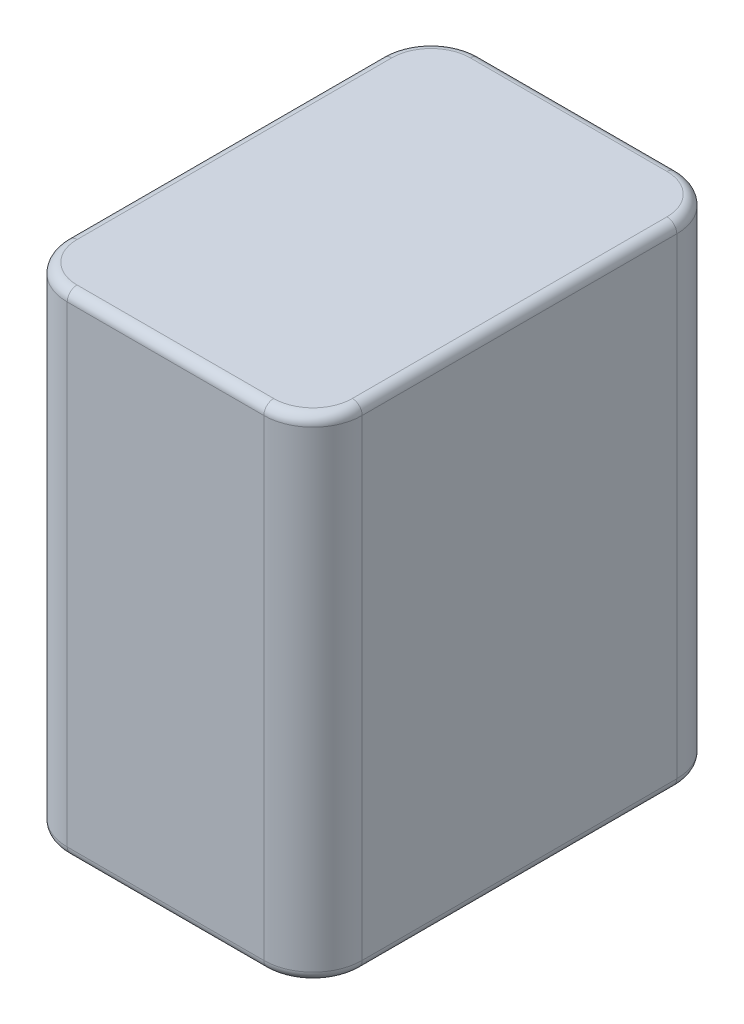
ISO-10303-21;
HEADER;
FILE_DESCRIPTION(('STEP AP214'),'2;1');
FILE_NAME('part.step','',(''),(''),'','','');
FILE_SCHEMA(('AUTOMOTIVE_DESIGN { 1 0 10303 214 1 1 1 1 }'));
ENDSEC;
DATA;
#1=APPLICATION_CONTEXT('core data for automotive mechanical design processes');
#2=APPLICATION_PROTOCOL_DEFINITION('international standard','automotive_design',2000,#1);
#3=PRODUCT_CONTEXT('',#1,'mechanical');
#4=PRODUCT('Part','Part','',(#3));
#5=PRODUCT_RELATED_PRODUCT_CATEGORY('part','',(#4));
#6=PRODUCT_DEFINITION_FORMATION('','',#4);
#7=PRODUCT_DEFINITION_CONTEXT('part definition',#1,'design');
#8=PRODUCT_DEFINITION('design','',#6,#7);
#9=PRODUCT_DEFINITION_SHAPE('','',#8);
#10=(LENGTH_UNIT() NAMED_UNIT(*) SI_UNIT(.MILLI.,.METRE.));
#11=(NAMED_UNIT(*) PLANE_ANGLE_UNIT() SI_UNIT($,.RADIAN.));
#12=(NAMED_UNIT(*) SI_UNIT($,.STERADIAN.) SOLID_ANGLE_UNIT());
#13=UNCERTAINTY_MEASURE_WITH_UNIT(LENGTH_MEASURE(1.E-05),#10,'distance_accuracy_value','');
#14=(GEOMETRIC_REPRESENTATION_CONTEXT(3) GLOBAL_UNCERTAINTY_ASSIGNED_CONTEXT((#13)) GLOBAL_UNIT_ASSIGNED_CONTEXT((#10,
#11,#12)) REPRESENTATION_CONTEXT('',''));
#15=CARTESIAN_POINT('',(0.,0.,0.));
#16=DIRECTION('',(0.,0.,1.));
#17=DIRECTION('',(1.,0.,0.));
#18=AXIS2_PLACEMENT_3D('',#15,#16,#17);
#19=CARTESIAN_POINT('',(0.,25.,0.));
#20=DIRECTION('',(1.,0.,0.));
#21=DIRECTION('',(0.,0.,-1.));
#22=AXIS2_PLACEMENT_3D('',#19,#20,#21);
#23=PLANE('',#22);
#24=DIRECTION('',(0.,-1.,0.));
#25=VECTOR('',#24,1.);
#26=CARTESIAN_POINT('',(0.,25.,-37.));
#27=LINE('',#26,#25);
#28=CARTESIAN_POINT('',(0.,24.,-37.));
#29=VERTEX_POINT('',#28);
#30=CARTESIAN_POINT('',(0.,-24.,-37.));
#31=VERTEX_POINT('',#30);
#32=EDGE_CURVE('E333',#29,#31,#27,.T.);
#33=ORIENTED_EDGE('',*,*,#32,.T.);
#34=DIRECTION('',(0.,0.,1.));
#35=VECTOR('',#34,1.);
#36=CARTESIAN_POINT('',(0.,-24.,-5.));
#37=LINE('',#36,#35);
#38=CARTESIAN_POINT('',(0.,-24.,-5.));
#39=VERTEX_POINT('',#38);
#40=EDGE_CURVE('E11',#31,#39,#37,.T.);
#41=ORIENTED_EDGE('',*,*,#40,.T.);
#42=DIRECTION('',(0.,-1.,0.));
#43=VECTOR('',#42,1.);
#44=CARTESIAN_POINT('',(0.,25.,-5.));
#45=LINE('',#44,#43);
#46=CARTESIAN_POINT('',(0.,24.,-5.));
#47=VERTEX_POINT('',#46);
#48=EDGE_CURVE('E242',#39,#47,#45,.F.);
#49=ORIENTED_EDGE('',*,*,#48,.T.);
#50=DIRECTION('',(0.,0.,1.));
#51=VECTOR('',#50,1.);
#52=CARTESIAN_POINT('',(0.,24.,0.));
#53=LINE('',#52,#51);
#54=EDGE_CURVE('E207',#47,#29,#53,.F.);
#55=ORIENTED_EDGE('',*,*,#54,.T.);
#56=EDGE_LOOP('',(#33,#41,#49,#55));
#57=FACE_BOUND('',#56,.T.);
#58=ADVANCED_FACE('F39',(#57),#23,.F.);
#59=CARTESIAN_POINT('',(0.,25.,0.));
#60=DIRECTION('',(0.,0.,-1.));
#61=DIRECTION('',(-1.,0.,0.));
#62=AXIS2_PLACEMENT_3D('',#59,#60,#61);
#63=PLANE('',#62);
#64=DIRECTION('',(0.,-1.,0.));
#65=VECTOR('',#64,1.);
#66=CARTESIAN_POINT('',(5.,25.,0.));
#67=LINE('',#66,#65);
#68=CARTESIAN_POINT('',(5.,24.,0.));
#69=VERTEX_POINT('',#68);
#70=CARTESIAN_POINT('',(5.,-24.,0.));
#71=VERTEX_POINT('',#70);
#72=EDGE_CURVE('E344',#69,#71,#67,.T.);
#73=ORIENTED_EDGE('',*,*,#72,.T.);
#74=DIRECTION('',(1.,0.,0.));
#75=VECTOR('',#74,1.);
#76=CARTESIAN_POINT('',(25.,-24.,0.));
#77=LINE('',#76,#75);
#78=CARTESIAN_POINT('',(25.,-24.,0.));
#79=VERTEX_POINT('',#78);
#80=EDGE_CURVE('E271',#71,#79,#77,.T.);
#81=ORIENTED_EDGE('',*,*,#80,.T.);
#82=DIRECTION('',(0.,-1.,0.));
#83=VECTOR('',#82,1.);
#84=CARTESIAN_POINT('',(25.,25.,0.));
#85=LINE('',#84,#83);
#86=CARTESIAN_POINT('',(25.,24.,0.));
#87=VERTEX_POINT('',#86);
#88=EDGE_CURVE('E337',#79,#87,#85,.F.);
#89=ORIENTED_EDGE('',*,*,#88,.T.);
#90=DIRECTION('',(1.,0.,0.));
#91=VECTOR('',#90,1.);
#92=CARTESIAN_POINT('',(0.,24.,0.));
#93=LINE('',#92,#91);
#94=EDGE_CURVE('E200',#87,#69,#93,.F.);
#95=ORIENTED_EDGE('',*,*,#94,.T.);
#96=EDGE_LOOP('',(#73,#81,#89,#95));
#97=FACE_BOUND('',#96,.T.);
#98=ADVANCED_FACE('F425',(#97),#63,.F.);
#99=CARTESIAN_POINT('',(30.,25.,0.));
#100=DIRECTION('',(-1.,0.,0.));
#101=DIRECTION('',(0.,0.,1.));
#102=AXIS2_PLACEMENT_3D('',#99,#100,#101);
#103=PLANE('',#102);
#104=DIRECTION('',(0.,-1.,0.));
#105=VECTOR('',#104,1.);
#106=CARTESIAN_POINT('',(30.,25.,-5.));
#107=LINE('',#106,#105);
#108=CARTESIAN_POINT('',(30.,24.,-5.));
#109=VERTEX_POINT('',#108);
#110=CARTESIAN_POINT('',(30.,-24.,-5.));
#111=VERTEX_POINT('',#110);
#112=EDGE_CURVE('E348',#109,#111,#107,.T.);
#113=ORIENTED_EDGE('',*,*,#112,.T.);
#114=DIRECTION('',(0.,0.,-1.));
#115=VECTOR('',#114,1.);
#116=CARTESIAN_POINT('',(30.,-24.,-37.));
#117=LINE('',#116,#115);
#118=CARTESIAN_POINT('',(30.,-24.,-37.));
#119=VERTEX_POINT('',#118);
#120=EDGE_CURVE('E277',#111,#119,#117,.T.);
#121=ORIENTED_EDGE('',*,*,#120,.T.);
#122=DIRECTION('',(0.,-1.,0.));
#123=VECTOR('',#122,1.);
#124=CARTESIAN_POINT('',(30.,25.,-37.));
#125=LINE('',#124,#123);
#126=CARTESIAN_POINT('',(30.,24.,-37.));
#127=VERTEX_POINT('',#126);
#128=EDGE_CURVE('E178',#119,#127,#125,.F.);
#129=ORIENTED_EDGE('',*,*,#128,.T.);
#130=DIRECTION('',(0.,0.,-1.));
#131=VECTOR('',#130,1.);
#132=CARTESIAN_POINT('',(30.,24.,0.));
#133=LINE('',#132,#131);
#134=EDGE_CURVE('E188',#127,#109,#133,.F.);
#135=ORIENTED_EDGE('',*,*,#134,.T.);
#136=EDGE_LOOP('',(#113,#121,#129,#135));
#137=FACE_BOUND('',#136,.T.);
#138=ADVANCED_FACE('F377',(#137),#103,.F.);
#139=CARTESIAN_POINT('',(0.,25.,-42.));
#140=DIRECTION('',(0.,0.,1.));
#141=DIRECTION('',(1.,0.,0.));
#142=AXIS2_PLACEMENT_3D('',#139,#140,#141);
#143=PLANE('',#142);
#144=DIRECTION('',(0.,-1.,0.));
#145=VECTOR('',#144,1.);
#146=CARTESIAN_POINT('',(25.,25.,-42.));
#147=LINE('',#146,#145);
#148=CARTESIAN_POINT('',(25.,24.,-42.));
#149=VERTEX_POINT('',#148);
#150=CARTESIAN_POINT('',(25.,-24.,-42.));
#151=VERTEX_POINT('',#150);
#152=EDGE_CURVE('E329',#149,#151,#147,.T.);
#153=ORIENTED_EDGE('',*,*,#152,.T.);
#154=DIRECTION('',(-1.,0.,0.));
#155=VECTOR('',#154,1.);
#156=CARTESIAN_POINT('',(5.,-24.,-42.));
#157=LINE('',#156,#155);
#158=CARTESIAN_POINT('',(5.,-24.,-42.));
#159=VERTEX_POINT('',#158);
#160=EDGE_CURVE('E64',#151,#159,#157,.T.);
#161=ORIENTED_EDGE('',*,*,#160,.T.);
#162=DIRECTION('',(0.,-1.,0.));
#163=VECTOR('',#162,1.);
#164=CARTESIAN_POINT('',(5.,25.,-42.));
#165=LINE('',#164,#163);
#166=CARTESIAN_POINT('',(5.,24.,-42.));
#167=VERTEX_POINT('',#166);
#168=EDGE_CURVE('E332',#159,#167,#165,.F.);
#169=ORIENTED_EDGE('',*,*,#168,.T.);
#170=DIRECTION('',(-1.,0.,0.));
#171=VECTOR('',#170,1.);
#172=CARTESIAN_POINT('',(0.,24.,-42.));
#173=LINE('',#172,#171);
#174=EDGE_CURVE('E214',#167,#149,#173,.F.);
#175=ORIENTED_EDGE('',*,*,#174,.T.);
#176=EDGE_LOOP('',(#153,#161,#169,#175));
#177=FACE_BOUND('',#176,.T.);
#178=ADVANCED_FACE('F330',(#177),#143,.F.);
#179=CARTESIAN_POINT('',(0.,25.,0.));
#180=DIRECTION('',(0.,-1.,0.));
#181=DIRECTION('',(0.,0.,-1.));
#182=AXIS2_PLACEMENT_3D('',#179,#180,#181);
#183=PLANE('',#182);
#184=DIRECTION('',(0.,0.,-1.));
#185=VECTOR('',#184,1.);
#186=CARTESIAN_POINT('',(29.,25.,0.));
#187=LINE('',#186,#185);
#188=CARTESIAN_POINT('',(29.,25.,-5.));
#189=VERTEX_POINT('',#188);
#190=CARTESIAN_POINT('',(29.,25.,-37.));
#191=VERTEX_POINT('',#190);
#192=EDGE_CURVE('E182',#189,#191,#187,.T.);
#193=ORIENTED_EDGE('',*,*,#192,.T.);
#194=CARTESIAN_POINT('',(25.,25.,-37.));
#195=DIRECTION('',(0.,-1.,0.));
#196=DIRECTION('',(0.,0.,-1.));
#197=AXIS2_PLACEMENT_3D('',#194,#195,#196);
#198=CIRCLE('',#197,4.);
#199=CARTESIAN_POINT('',(25.,25.,-41.));
#200=VERTEX_POINT('',#199);
#201=EDGE_CURVE('E161',#191,#200,#198,.F.);
#202=ORIENTED_EDGE('',*,*,#201,.T.);
#203=DIRECTION('',(-1.,0.,0.));
#204=VECTOR('',#203,1.);
#205=CARTESIAN_POINT('',(0.,25.,-41.));
#206=LINE('',#205,#204);
#207=CARTESIAN_POINT('',(5.,25.,-41.));
#208=VERTEX_POINT('',#207);
#209=EDGE_CURVE('E170',#200,#208,#206,.T.);
#210=ORIENTED_EDGE('',*,*,#209,.T.);
#211=CARTESIAN_POINT('',(5.,25.,-37.));
#212=DIRECTION('',(0.,-1.,0.));
#213=DIRECTION('',(0.,0.,-1.));
#214=AXIS2_PLACEMENT_3D('',#211,#212,#213);
#215=CIRCLE('',#214,4.);
#216=CARTESIAN_POINT('',(0.999999999999999,25.,-37.));
#217=VERTEX_POINT('',#216);
#218=EDGE_CURVE('E177',#208,#217,#215,.F.);
#219=ORIENTED_EDGE('',*,*,#218,.T.);
#220=DIRECTION('',(0.,0.,1.));
#221=VECTOR('',#220,1.);
#222=CARTESIAN_POINT('',(1.,25.,0.));
#223=LINE('',#222,#221);
#224=CARTESIAN_POINT('',(1.,25.,-5.));
#225=VERTEX_POINT('',#224);
#226=EDGE_CURVE('E356',#217,#225,#223,.T.);
#227=ORIENTED_EDGE('',*,*,#226,.T.);
#228=CARTESIAN_POINT('',(5.,25.,-5.));
#229=DIRECTION('',(0.,-1.,0.));
#230=DIRECTION('',(0.,0.,-1.));
#231=AXIS2_PLACEMENT_3D('',#228,#229,#230);
#232=CIRCLE('',#231,4.);
#233=CARTESIAN_POINT('',(5.,25.,-1.));
#234=VERTEX_POINT('',#233);
#235=EDGE_CURVE('E359',#225,#234,#232,.F.);
#236=ORIENTED_EDGE('',*,*,#235,.T.);
#237=DIRECTION('',(1.,0.,0.));
#238=VECTOR('',#237,1.);
#239=CARTESIAN_POINT('',(0.,25.,-1.));
#240=LINE('',#239,#238);
#241=CARTESIAN_POINT('',(25.,25.,-1.));
#242=VERTEX_POINT('',#241);
#243=EDGE_CURVE('E362',#234,#242,#240,.T.);
#244=ORIENTED_EDGE('',*,*,#243,.T.);
#245=CARTESIAN_POINT('',(25.,25.,-5.));
#246=DIRECTION('',(0.,-1.,0.));
#247=DIRECTION('',(0.,0.,-1.));
#248=AXIS2_PLACEMENT_3D('',#245,#246,#247);
#249=CIRCLE('',#248,4.);
#250=EDGE_CURVE('E190',#242,#189,#249,.F.);
#251=ORIENTED_EDGE('',*,*,#250,.T.);
#252=EDGE_LOOP('',(#193,#202,#210,#219,#227,#236,#244,#251));
#253=FACE_BOUND('',#252,.T.);
#254=ADVANCED_FACE('F180',(#253),#183,.F.);
#255=CARTESIAN_POINT('',(0.,-25.,0.));
#256=DIRECTION('',(0.,-1.,0.));
#257=DIRECTION('',(0.,0.,-1.));
#258=AXIS2_PLACEMENT_3D('',#255,#256,#257);
#259=PLANE('',#258);
#260=DIRECTION('',(1.,0.,0.));
#261=VECTOR('',#260,1.);
#262=CARTESIAN_POINT('',(5.,-25.,-1.));
#263=LINE('',#262,#261);
#264=CARTESIAN_POINT('',(25.,-25.,-1.));
#265=VERTEX_POINT('',#264);
#266=CARTESIAN_POINT('',(5.,-25.,-1.));
#267=VERTEX_POINT('',#266);
#268=EDGE_CURVE('E260',#265,#267,#263,.F.);
#269=ORIENTED_EDGE('',*,*,#268,.T.);
#270=CARTESIAN_POINT('',(5.,-25.,-5.));
#271=DIRECTION('',(0.,-1.,0.));
#272=DIRECTION('',(0.,0.,-1.));
#273=AXIS2_PLACEMENT_3D('',#270,#271,#272);
#274=CIRCLE('',#273,4.);
#275=CARTESIAN_POINT('',(1.,-25.,-5.));
#276=VERTEX_POINT('',#275);
#277=EDGE_CURVE('E263',#267,#276,#274,.T.);
#278=ORIENTED_EDGE('',*,*,#277,.T.);
#279=DIRECTION('',(0.,0.,1.));
#280=VECTOR('',#279,1.);
#281=CARTESIAN_POINT('',(1.,-25.,-37.));
#282=LINE('',#281,#280);
#283=CARTESIAN_POINT('',(1.,-25.,-37.));
#284=VERTEX_POINT('',#283);
#285=EDGE_CURVE('E216',#276,#284,#282,.F.);
#286=ORIENTED_EDGE('',*,*,#285,.T.);
#287=CARTESIAN_POINT('',(5.,-25.,-37.));
#288=DIRECTION('',(0.,-1.,0.));
#289=DIRECTION('',(0.,0.,-1.));
#290=AXIS2_PLACEMENT_3D('',#287,#288,#289);
#291=CIRCLE('',#290,4.);
#292=CARTESIAN_POINT('',(5.,-25.,-41.));
#293=VERTEX_POINT('',#292);
#294=EDGE_CURVE('E245',#284,#293,#291,.T.);
#295=ORIENTED_EDGE('',*,*,#294,.T.);
#296=DIRECTION('',(-1.,0.,0.));
#297=VECTOR('',#296,1.);
#298=CARTESIAN_POINT('',(25.,-25.,-41.));
#299=LINE('',#298,#297);
#300=CARTESIAN_POINT('',(25.,-25.,-41.));
#301=VERTEX_POINT('',#300);
#302=EDGE_CURVE('E248',#293,#301,#299,.F.);
#303=ORIENTED_EDGE('',*,*,#302,.T.);
#304=CARTESIAN_POINT('',(25.,-25.,-37.));
#305=DIRECTION('',(0.,-1.,0.));
#306=DIRECTION('',(0.,0.,-1.));
#307=AXIS2_PLACEMENT_3D('',#304,#305,#306);
#308=CIRCLE('',#307,4.);
#309=CARTESIAN_POINT('',(29.,-25.,-37.));
#310=VERTEX_POINT('',#309);
#311=EDGE_CURVE('E251',#301,#310,#308,.T.);
#312=ORIENTED_EDGE('',*,*,#311,.T.);
#313=DIRECTION('',(0.,0.,-1.));
#314=VECTOR('',#313,1.);
#315=CARTESIAN_POINT('',(29.,-25.,-5.));
#316=LINE('',#315,#314);
#317=CARTESIAN_POINT('',(29.,-25.,-5.));
#318=VERTEX_POINT('',#317);
#319=EDGE_CURVE('E254',#310,#318,#316,.F.);
#320=ORIENTED_EDGE('',*,*,#319,.T.);
#321=CARTESIAN_POINT('',(25.,-25.,-5.));
#322=DIRECTION('',(0.,-1.,0.));
#323=DIRECTION('',(0.,0.,-1.));
#324=AXIS2_PLACEMENT_3D('',#321,#322,#323);
#325=CIRCLE('',#324,4.);
#326=EDGE_CURVE('E257',#318,#265,#325,.T.);
#327=ORIENTED_EDGE('',*,*,#326,.T.);
#328=EDGE_LOOP('',(#269,#278,#286,#295,#303,#312,#320,#327));
#329=FACE_BOUND('',#328,.T.);
#330=ADVANCED_FACE('F394',(#329),#259,.T.);
#331=CARTESIAN_POINT('',(5.,25.,-37.));
#332=DIRECTION('',(0.,-1.,0.));
#333=DIRECTION('',(0.,0.,-1.));
#334=AXIS2_PLACEMENT_3D('',#331,#332,#333);
#335=CYLINDRICAL_SURFACE('',#334,5.);
#336=ORIENTED_EDGE('',*,*,#168,.F.);
#337=CARTESIAN_POINT('',(5.,-24.,-37.));
#338=DIRECTION('',(0.,-1.,0.));
#339=DIRECTION('',(0.,0.,-1.));
#340=AXIS2_PLACEMENT_3D('',#337,#338,#339);
#341=CIRCLE('',#340,5.);
#342=EDGE_CURVE('E49',#159,#31,#341,.F.);
#343=ORIENTED_EDGE('',*,*,#342,.T.);
#344=ORIENTED_EDGE('',*,*,#32,.F.);
#345=CARTESIAN_POINT('',(5.,24.,-37.));
#346=DIRECTION('',(0.,-1.,0.));
#347=DIRECTION('',(0.,0.,-1.));
#348=AXIS2_PLACEMENT_3D('',#345,#346,#347);
#349=CIRCLE('',#348,5.);
#350=EDGE_CURVE('E210',#29,#167,#349,.T.);
#351=ORIENTED_EDGE('',*,*,#350,.T.);
#352=EDGE_LOOP('',(#336,#343,#344,#351));
#353=FACE_BOUND('',#352,.T.);
#354=ADVANCED_FACE('F434',(#353),#335,.T.);
#355=CARTESIAN_POINT('',(5.,25.,-5.));
#356=DIRECTION('',(0.,-1.,0.));
#357=DIRECTION('',(0.,0.,-1.));
#358=AXIS2_PLACEMENT_3D('',#355,#356,#357);
#359=CYLINDRICAL_SURFACE('',#358,5.);
#360=ORIENTED_EDGE('',*,*,#48,.F.);
#361=CARTESIAN_POINT('',(5.,-24.,-5.));
#362=DIRECTION('',(0.,-1.,0.));
#363=DIRECTION('',(0.,0.,-1.));
#364=AXIS2_PLACEMENT_3D('',#361,#362,#363);
#365=CIRCLE('',#364,5.);
#366=EDGE_CURVE('E267',#39,#71,#365,.F.);
#367=ORIENTED_EDGE('',*,*,#366,.T.);
#368=ORIENTED_EDGE('',*,*,#72,.F.);
#369=CARTESIAN_POINT('',(5.,24.,-5.));
#370=DIRECTION('',(0.,-1.,0.));
#371=DIRECTION('',(0.,0.,-1.));
#372=AXIS2_PLACEMENT_3D('',#369,#370,#371);
#373=CIRCLE('',#372,5.);
#374=EDGE_CURVE('E203',#69,#47,#373,.T.);
#375=ORIENTED_EDGE('',*,*,#374,.T.);
#376=EDGE_LOOP('',(#360,#367,#368,#375));
#377=FACE_BOUND('',#376,.T.);
#378=ADVANCED_FACE('F410',(#377),#359,.T.);
#379=CARTESIAN_POINT('',(25.,25.,-37.));
#380=DIRECTION('',(0.,-1.,0.));
#381=DIRECTION('',(0.,0.,-1.));
#382=AXIS2_PLACEMENT_3D('',#379,#380,#381);
#383=CYLINDRICAL_SURFACE('',#382,5.);
#384=ORIENTED_EDGE('',*,*,#128,.F.);
#385=CARTESIAN_POINT('',(25.,-24.,-37.));
#386=DIRECTION('',(0.,-1.,0.));
#387=DIRECTION('',(0.,0.,-1.));
#388=AXIS2_PLACEMENT_3D('',#385,#386,#387);
#389=CIRCLE('',#388,5.);
#390=EDGE_CURVE('E280',#119,#151,#389,.F.);
#391=ORIENTED_EDGE('',*,*,#390,.T.);
#392=ORIENTED_EDGE('',*,*,#152,.F.);
#393=CARTESIAN_POINT('',(25.,24.,-37.));
#394=DIRECTION('',(0.,-1.,0.));
#395=DIRECTION('',(0.,0.,-1.));
#396=AXIS2_PLACEMENT_3D('',#393,#394,#395);
#397=CIRCLE('',#396,5.);
#398=EDGE_CURVE('E163',#149,#127,#397,.T.);
#399=ORIENTED_EDGE('',*,*,#398,.T.);
#400=EDGE_LOOP('',(#384,#391,#392,#399));
#401=FACE_BOUND('',#400,.T.);
#402=ADVANCED_FACE('F328',(#401),#383,.T.);
#403=CARTESIAN_POINT('',(25.,25.,-5.));
#404=DIRECTION('',(0.,-1.,0.));
#405=DIRECTION('',(0.,0.,-1.));
#406=AXIS2_PLACEMENT_3D('',#403,#404,#405);
#407=CYLINDRICAL_SURFACE('',#406,5.);
#408=ORIENTED_EDGE('',*,*,#88,.F.);
#409=CARTESIAN_POINT('',(25.,-24.,-5.));
#410=DIRECTION('',(0.,-1.,0.));
#411=DIRECTION('',(0.,0.,-1.));
#412=AXIS2_PLACEMENT_3D('',#409,#410,#411);
#413=CIRCLE('',#412,5.);
#414=EDGE_CURVE('E274',#79,#111,#413,.F.);
#415=ORIENTED_EDGE('',*,*,#414,.T.);
#416=ORIENTED_EDGE('',*,*,#112,.F.);
#417=CARTESIAN_POINT('',(25.,24.,-5.));
#418=DIRECTION('',(0.,-1.,0.));
#419=DIRECTION('',(0.,0.,-1.));
#420=AXIS2_PLACEMENT_3D('',#417,#418,#419);
#421=CIRCLE('',#420,5.);
#422=EDGE_CURVE('E196',#109,#87,#421,.T.);
#423=ORIENTED_EDGE('',*,*,#422,.T.);
#424=EDGE_LOOP('',(#408,#415,#416,#423));
#425=FACE_BOUND('',#424,.T.);
#426=ADVANCED_FACE('F380',(#425),#407,.T.);
#427=CARTESIAN_POINT('',(5.,24.,-5.));
#428=DIRECTION('',(0.,-1.,0.));
#429=DIRECTION('',(0.,0.,-1.));
#430=AXIS2_PLACEMENT_3D('',#427,#428,#429);
#431=TOROIDAL_SURFACE('',#430,4.,1.);
#432=CARTESIAN_POINT('',(0.999999999999999,24.,-5.));
#433=DIRECTION('',(0.,0.,-1.));
#434=DIRECTION('',(-1.,0.,0.));
#435=AXIS2_PLACEMENT_3D('',#432,#433,#434);
#436=CIRCLE('',#435,1.);
#437=EDGE_CURVE('E234',#47,#225,#436,.T.);
#438=ORIENTED_EDGE('',*,*,#437,.F.);
#439=ORIENTED_EDGE('',*,*,#374,.F.);
#440=CARTESIAN_POINT('',(5.,24.,-1.));
#441=DIRECTION('',(1.,0.,0.));
#442=DIRECTION('',(0.,0.,-1.));
#443=AXIS2_PLACEMENT_3D('',#440,#441,#442);
#444=CIRCLE('',#443,1.);
#445=EDGE_CURVE('E238',#234,#69,#444,.T.);
#446=ORIENTED_EDGE('',*,*,#445,.F.);
#447=ORIENTED_EDGE('',*,*,#235,.F.);
#448=EDGE_LOOP('',(#438,#439,#446,#447));
#449=FACE_BOUND('',#448,.T.);
#450=ADVANCED_FACE('F443',(#449),#431,.T.);
#451=CARTESIAN_POINT('',(0.,24.,-1.));
#452=DIRECTION('',(1.,0.,0.));
#453=DIRECTION('',(0.,0.,-1.));
#454=AXIS2_PLACEMENT_3D('',#451,#452,#453);
#455=CYLINDRICAL_SURFACE('',#454,1.);
#456=ORIENTED_EDGE('',*,*,#445,.T.);
#457=ORIENTED_EDGE('',*,*,#94,.F.);
#458=CARTESIAN_POINT('',(25.,24.,-1.));
#459=DIRECTION('',(1.,0.,0.));
#460=DIRECTION('',(0.,0.,-1.));
#461=AXIS2_PLACEMENT_3D('',#458,#459,#460);
#462=CIRCLE('',#461,1.);
#463=EDGE_CURVE('E230',#242,#87,#462,.T.);
#464=ORIENTED_EDGE('',*,*,#463,.F.);
#465=ORIENTED_EDGE('',*,*,#243,.F.);
#466=EDGE_LOOP('',(#456,#457,#464,#465));
#467=FACE_BOUND('',#466,.T.);
#468=ADVANCED_FACE('F459',(#467),#455,.T.);
#469=CARTESIAN_POINT('',(1.,24.,0.));
#470=DIRECTION('',(0.,0.,1.));
#471=DIRECTION('',(1.,0.,0.));
#472=AXIS2_PLACEMENT_3D('',#469,#470,#471);
#473=CYLINDRICAL_SURFACE('',#472,1.);
#474=ORIENTED_EDGE('',*,*,#437,.T.);
#475=ORIENTED_EDGE('',*,*,#226,.F.);
#476=CARTESIAN_POINT('',(1.,24.,-37.));
#477=DIRECTION('',(0.,0.,-1.));
#478=DIRECTION('',(-1.,0.,0.));
#479=AXIS2_PLACEMENT_3D('',#476,#477,#478);
#480=CIRCLE('',#479,1.);
#481=EDGE_CURVE('E226',#29,#217,#480,.T.);
#482=ORIENTED_EDGE('',*,*,#481,.F.);
#483=ORIENTED_EDGE('',*,*,#54,.F.);
#484=EDGE_LOOP('',(#474,#475,#482,#483));
#485=FACE_BOUND('',#484,.T.);
#486=ADVANCED_FACE('F456',(#485),#473,.T.);
#487=CARTESIAN_POINT('',(25.,24.,-5.));
#488=DIRECTION('',(0.,-1.,0.));
#489=DIRECTION('',(0.,0.,-1.));
#490=AXIS2_PLACEMENT_3D('',#487,#488,#489);
#491=TOROIDAL_SURFACE('',#490,4.,1.);
#492=ORIENTED_EDGE('',*,*,#463,.T.);
#493=ORIENTED_EDGE('',*,*,#422,.F.);
#494=CARTESIAN_POINT('',(29.,24.,-5.));
#495=DIRECTION('',(0.,0.,-1.));
#496=DIRECTION('',(-1.,0.,0.));
#497=AXIS2_PLACEMENT_3D('',#494,#495,#496);
#498=CIRCLE('',#497,1.);
#499=EDGE_CURVE('E222',#189,#109,#498,.T.);
#500=ORIENTED_EDGE('',*,*,#499,.F.);
#501=ORIENTED_EDGE('',*,*,#250,.F.);
#502=EDGE_LOOP('',(#492,#493,#500,#501));
#503=FACE_BOUND('',#502,.T.);
#504=ADVANCED_FACE('F371',(#503),#491,.T.);
#505=CARTESIAN_POINT('',(5.,24.,-37.));
#506=DIRECTION('',(0.,-1.,0.));
#507=DIRECTION('',(0.,0.,-1.));
#508=AXIS2_PLACEMENT_3D('',#505,#506,#507);
#509=TOROIDAL_SURFACE('',#508,4.,1.);
#510=ORIENTED_EDGE('',*,*,#481,.T.);
#511=ORIENTED_EDGE('',*,*,#218,.F.);
#512=CARTESIAN_POINT('',(5.,24.,-41.));
#513=DIRECTION('',(1.,0.,0.));
#514=DIRECTION('',(0.,0.,-1.));
#515=AXIS2_PLACEMENT_3D('',#512,#513,#514);
#516=CIRCLE('',#515,1.);
#517=EDGE_CURVE('E173',#167,#208,#516,.T.);
#518=ORIENTED_EDGE('',*,*,#517,.F.);
#519=ORIENTED_EDGE('',*,*,#350,.F.);
#520=EDGE_LOOP('',(#510,#511,#518,#519));
#521=FACE_BOUND('',#520,.T.);
#522=ADVANCED_FACE('F450',(#521),#509,.T.);
#523=CARTESIAN_POINT('',(29.,24.,0.));
#524=DIRECTION('',(0.,0.,-1.));
#525=DIRECTION('',(-1.,0.,0.));
#526=AXIS2_PLACEMENT_3D('',#523,#524,#525);
#527=CYLINDRICAL_SURFACE('',#526,1.);
#528=ORIENTED_EDGE('',*,*,#499,.T.);
#529=ORIENTED_EDGE('',*,*,#134,.F.);
#530=CARTESIAN_POINT('',(29.,24.,-37.));
#531=DIRECTION('',(0.,0.,-1.));
#532=DIRECTION('',(-1.,0.,0.));
#533=AXIS2_PLACEMENT_3D('',#530,#531,#532);
#534=CIRCLE('',#533,1.);
#535=EDGE_CURVE('E167',#191,#127,#534,.T.);
#536=ORIENTED_EDGE('',*,*,#535,.F.);
#537=ORIENTED_EDGE('',*,*,#192,.F.);
#538=EDGE_LOOP('',(#528,#529,#536,#537));
#539=FACE_BOUND('',#538,.T.);
#540=ADVANCED_FACE('F374',(#539),#527,.T.);
#541=CARTESIAN_POINT('',(0.,24.,-41.));
#542=DIRECTION('',(-1.,0.,0.));
#543=DIRECTION('',(0.,0.,1.));
#544=AXIS2_PLACEMENT_3D('',#541,#542,#543);
#545=CYLINDRICAL_SURFACE('',#544,1.);
#546=ORIENTED_EDGE('',*,*,#517,.T.);
#547=ORIENTED_EDGE('',*,*,#209,.F.);
#548=CARTESIAN_POINT('',(25.,24.,-41.));
#549=DIRECTION('',(1.,0.,0.));
#550=DIRECTION('',(0.,0.,-1.));
#551=AXIS2_PLACEMENT_3D('',#548,#549,#550);
#552=CIRCLE('',#551,1.);
#553=EDGE_CURVE('E156',#149,#200,#552,.T.);
#554=ORIENTED_EDGE('',*,*,#553,.F.);
#555=ORIENTED_EDGE('',*,*,#174,.F.);
#556=EDGE_LOOP('',(#546,#547,#554,#555));
#557=FACE_BOUND('',#556,.T.);
#558=ADVANCED_FACE('F171',(#557),#545,.T.);
#559=CARTESIAN_POINT('',(25.,24.,-37.));
#560=DIRECTION('',(0.,-1.,0.));
#561=DIRECTION('',(0.,0.,-1.));
#562=AXIS2_PLACEMENT_3D('',#559,#560,#561);
#563=TOROIDAL_SURFACE('',#562,4.,1.);
#564=ORIENTED_EDGE('',*,*,#535,.T.);
#565=ORIENTED_EDGE('',*,*,#398,.F.);
#566=ORIENTED_EDGE('',*,*,#553,.T.);
#567=ORIENTED_EDGE('',*,*,#201,.F.);
#568=EDGE_LOOP('',(#564,#565,#566,#567));
#569=FACE_BOUND('',#568,.T.);
#570=ADVANCED_FACE('F159',(#569),#563,.T.);
#571=CARTESIAN_POINT('',(25.,-24.,-37.));
#572=DIRECTION('',(0.,-1.,0.));
#573=DIRECTION('',(0.,0.,-1.));
#574=AXIS2_PLACEMENT_3D('',#571,#572,#573);
#575=TOROIDAL_SURFACE('',#574,4.,1.);
#576=CARTESIAN_POINT('',(25.,-24.,-41.));
#577=DIRECTION('',(-1.,0.,0.));
#578=DIRECTION('',(0.,0.,1.));
#579=AXIS2_PLACEMENT_3D('',#576,#577,#578);
#580=CIRCLE('',#579,1.);
#581=EDGE_CURVE('E308',#151,#301,#580,.T.);
#582=ORIENTED_EDGE('',*,*,#581,.F.);
#583=ORIENTED_EDGE('',*,*,#390,.F.);
#584=CARTESIAN_POINT('',(29.,-24.,-37.));
#585=DIRECTION('',(0.,0.,1.));
#586=DIRECTION('',(1.,0.,0.));
#587=AXIS2_PLACEMENT_3D('',#584,#585,#586);
#588=CIRCLE('',#587,1.);
#589=EDGE_CURVE('E43',#310,#119,#588,.T.);
#590=ORIENTED_EDGE('',*,*,#589,.F.);
#591=ORIENTED_EDGE('',*,*,#311,.F.);
#592=EDGE_LOOP('',(#582,#583,#590,#591));
#593=FACE_BOUND('',#592,.T.);
#594=ADVANCED_FACE('F41',(#593),#575,.T.);
#595=CARTESIAN_POINT('',(29.,-24.,0.));
#596=DIRECTION('',(0.,0.,1.));
#597=DIRECTION('',(1.,0.,0.));
#598=AXIS2_PLACEMENT_3D('',#595,#596,#597);
#599=CYLINDRICAL_SURFACE('',#598,1.);
#600=ORIENTED_EDGE('',*,*,#589,.T.);
#601=ORIENTED_EDGE('',*,*,#120,.F.);
#602=CARTESIAN_POINT('',(29.,-24.,-5.));
#603=DIRECTION('',(0.,0.,1.));
#604=DIRECTION('',(1.,0.,0.));
#605=AXIS2_PLACEMENT_3D('',#602,#603,#604);
#606=CIRCLE('',#605,1.);
#607=EDGE_CURVE('E305',#318,#111,#606,.T.);
#608=ORIENTED_EDGE('',*,*,#607,.F.);
#609=ORIENTED_EDGE('',*,*,#319,.F.);
#610=EDGE_LOOP('',(#600,#601,#608,#609));
#611=FACE_BOUND('',#610,.T.);
#612=ADVANCED_FACE('F320',(#611),#599,.T.);
#613=CARTESIAN_POINT('',(0.,-24.,-41.));
#614=DIRECTION('',(1.,0.,0.));
#615=DIRECTION('',(0.,0.,-1.));
#616=AXIS2_PLACEMENT_3D('',#613,#614,#615);
#617=CYLINDRICAL_SURFACE('',#616,1.);
#618=ORIENTED_EDGE('',*,*,#581,.T.);
#619=ORIENTED_EDGE('',*,*,#302,.F.);
#620=CARTESIAN_POINT('',(5.,-24.,-41.));
#621=DIRECTION('',(-1.,0.,0.));
#622=DIRECTION('',(0.,0.,1.));
#623=AXIS2_PLACEMENT_3D('',#620,#621,#622);
#624=CIRCLE('',#623,1.);
#625=EDGE_CURVE('E301',#159,#293,#624,.T.);
#626=ORIENTED_EDGE('',*,*,#625,.F.);
#627=ORIENTED_EDGE('',*,*,#160,.F.);
#628=EDGE_LOOP('',(#618,#619,#626,#627));
#629=FACE_BOUND('',#628,.T.);
#630=ADVANCED_FACE('F397',(#629),#617,.T.);
#631=CARTESIAN_POINT('',(25.,-24.,-5.));
#632=DIRECTION('',(0.,-1.,0.));
#633=DIRECTION('',(0.,0.,-1.));
#634=AXIS2_PLACEMENT_3D('',#631,#632,#633);
#635=TOROIDAL_SURFACE('',#634,4.,1.);
#636=ORIENTED_EDGE('',*,*,#607,.T.);
#637=ORIENTED_EDGE('',*,*,#414,.F.);
#638=CARTESIAN_POINT('',(25.,-24.,-1.));
#639=DIRECTION('',(-1.,0.,0.));
#640=DIRECTION('',(0.,0.,1.));
#641=AXIS2_PLACEMENT_3D('',#638,#639,#640);
#642=CIRCLE('',#641,1.);
#643=EDGE_CURVE('E297',#265,#79,#642,.T.);
#644=ORIENTED_EDGE('',*,*,#643,.F.);
#645=ORIENTED_EDGE('',*,*,#326,.F.);
#646=EDGE_LOOP('',(#636,#637,#644,#645));
#647=FACE_BOUND('',#646,.T.);
#648=ADVANCED_FACE('F385',(#647),#635,.T.);
#649=CARTESIAN_POINT('',(5.,-24.,-37.));
#650=DIRECTION('',(0.,-1.,0.));
#651=DIRECTION('',(0.,0.,-1.));
#652=AXIS2_PLACEMENT_3D('',#649,#650,#651);
#653=TOROIDAL_SURFACE('',#652,4.,1.);
#654=ORIENTED_EDGE('',*,*,#625,.T.);
#655=ORIENTED_EDGE('',*,*,#294,.F.);
#656=CARTESIAN_POINT('',(0.999999999999999,-24.,-37.));
#657=DIRECTION('',(0.,0.,1.));
#658=DIRECTION('',(1.,0.,0.));
#659=AXIS2_PLACEMENT_3D('',#656,#657,#658);
#660=CIRCLE('',#659,1.);
#661=EDGE_CURVE('E293',#31,#284,#660,.T.);
#662=ORIENTED_EDGE('',*,*,#661,.F.);
#663=ORIENTED_EDGE('',*,*,#342,.F.);
#664=EDGE_LOOP('',(#654,#655,#662,#663));
#665=FACE_BOUND('',#664,.T.);
#666=ADVANCED_FACE('F399',(#665),#653,.T.);
#667=CARTESIAN_POINT('',(0.,-24.,-1.));
#668=DIRECTION('',(-1.,0.,0.));
#669=DIRECTION('',(0.,0.,1.));
#670=AXIS2_PLACEMENT_3D('',#667,#668,#669);
#671=CYLINDRICAL_SURFACE('',#670,1.);
#672=ORIENTED_EDGE('',*,*,#643,.T.);
#673=ORIENTED_EDGE('',*,*,#80,.F.);
#674=CARTESIAN_POINT('',(5.,-24.,-1.));
#675=DIRECTION('',(-1.,0.,0.));
#676=DIRECTION('',(0.,0.,1.));
#677=AXIS2_PLACEMENT_3D('',#674,#675,#676);
#678=CIRCLE('',#677,1.);
#679=EDGE_CURVE('E290',#267,#71,#678,.T.);
#680=ORIENTED_EDGE('',*,*,#679,.F.);
#681=ORIENTED_EDGE('',*,*,#268,.F.);
#682=EDGE_LOOP('',(#672,#673,#680,#681));
#683=FACE_BOUND('',#682,.T.);
#684=ADVANCED_FACE('F390',(#683),#671,.T.);
#685=CARTESIAN_POINT('',(1.,-24.,0.));
#686=DIRECTION('',(0.,0.,-1.));
#687=DIRECTION('',(-1.,0.,0.));
#688=AXIS2_PLACEMENT_3D('',#685,#686,#687);
#689=CYLINDRICAL_SURFACE('',#688,1.);
#690=ORIENTED_EDGE('',*,*,#661,.T.);
#691=ORIENTED_EDGE('',*,*,#285,.F.);
#692=CARTESIAN_POINT('',(1.,-24.,-5.));
#693=DIRECTION('',(0.,0.,1.));
#694=DIRECTION('',(1.,0.,0.));
#695=AXIS2_PLACEMENT_3D('',#692,#693,#694);
#696=CIRCLE('',#695,1.);
#697=EDGE_CURVE('E287',#39,#276,#696,.T.);
#698=ORIENTED_EDGE('',*,*,#697,.F.);
#699=ORIENTED_EDGE('',*,*,#40,.F.);
#700=EDGE_LOOP('',(#690,#691,#698,#699));
#701=FACE_BOUND('',#700,.T.);
#702=ADVANCED_FACE('F405',(#701),#689,.T.);
#703=CARTESIAN_POINT('',(5.,-24.,-5.));
#704=DIRECTION('',(0.,-1.,0.));
#705=DIRECTION('',(0.,0.,-1.));
#706=AXIS2_PLACEMENT_3D('',#703,#704,#705);
#707=TOROIDAL_SURFACE('',#706,4.,1.);
#708=ORIENTED_EDGE('',*,*,#679,.T.);
#709=ORIENTED_EDGE('',*,*,#366,.F.);
#710=ORIENTED_EDGE('',*,*,#697,.T.);
#711=ORIENTED_EDGE('',*,*,#277,.F.);
#712=EDGE_LOOP('',(#708,#709,#710,#711));
#713=FACE_BOUND('',#712,.T.);
#714=ADVANCED_FACE('F416',(#713),#707,.T.);
#715=CLOSED_SHELL('',(#58,#98,#138,#178,#254,#330,#354,#378,#402,#426,#450,#468,#486,#504,#522,
#540,#558,#570,#594,#612,#630,#648,#666,#684,#702,#714));
#716=MANIFOLD_SOLID_BREP('B2',#715);
#717=ADVANCED_BREP_SHAPE_REPRESENTATION('',(#18,#716),#14);
#718=SHAPE_DEFINITION_REPRESENTATION(#9,#717);
ENDSEC;
END-ISO-10303-21;
